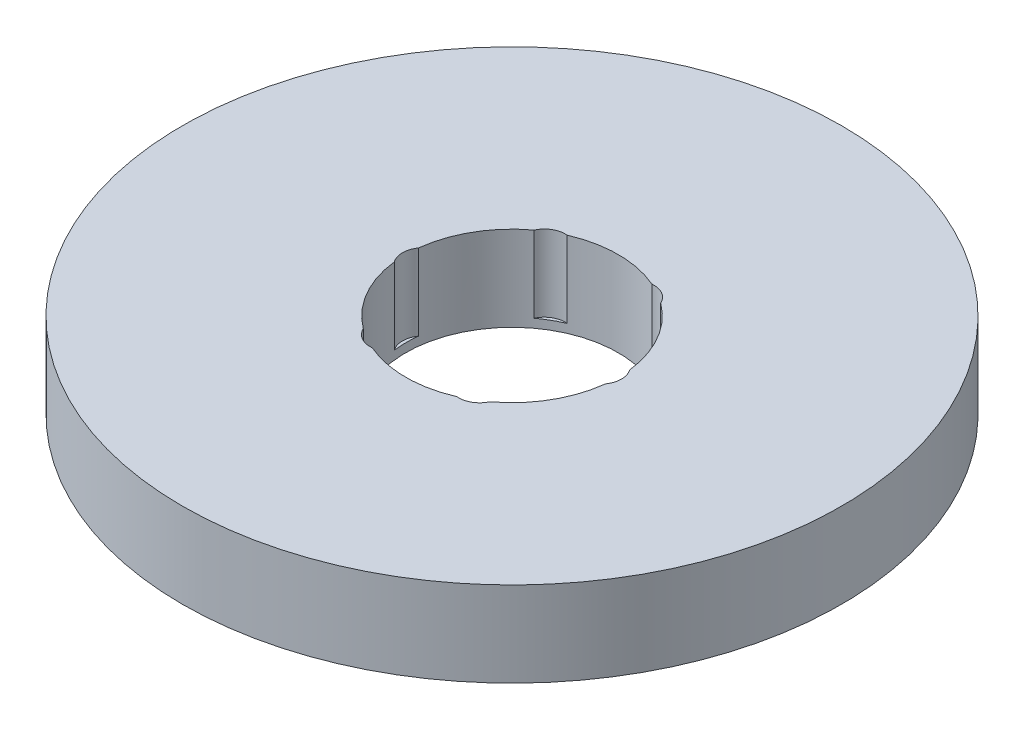
ISO-10303-21;
HEADER;
FILE_DESCRIPTION(('STEP AP214'),'2;1');
FILE_NAME('part.step','',(''),(''),'','','');
FILE_SCHEMA(('AUTOMOTIVE_DESIGN { 1 0 10303 214 1 1 1 1 }'));
ENDSEC;
DATA;
#1=APPLICATION_CONTEXT('core data for automotive mechanical design processes');
#2=APPLICATION_PROTOCOL_DEFINITION('international standard','automotive_design',2000,#1);
#3=PRODUCT_CONTEXT('',#1,'mechanical');
#4=PRODUCT('Part','Part','',(#3));
#5=PRODUCT_RELATED_PRODUCT_CATEGORY('part','',(#4));
#6=PRODUCT_DEFINITION_FORMATION('','',#4);
#7=PRODUCT_DEFINITION_CONTEXT('part definition',#1,'design');
#8=PRODUCT_DEFINITION('design','',#6,#7);
#9=PRODUCT_DEFINITION_SHAPE('','',#8);
#10=(LENGTH_UNIT() NAMED_UNIT(*) SI_UNIT(.MILLI.,.METRE.));
#11=(NAMED_UNIT(*) PLANE_ANGLE_UNIT() SI_UNIT($,.RADIAN.));
#12=(NAMED_UNIT(*) SI_UNIT($,.STERADIAN.) SOLID_ANGLE_UNIT());
#13=UNCERTAINTY_MEASURE_WITH_UNIT(LENGTH_MEASURE(1.E-05),#10,'distance_accuracy_value','');
#14=(GEOMETRIC_REPRESENTATION_CONTEXT(3) GLOBAL_UNCERTAINTY_ASSIGNED_CONTEXT((#13)) GLOBAL_UNIT_ASSIGNED_CONTEXT((#10,
#11,#12)) REPRESENTATION_CONTEXT('',''));
#15=CARTESIAN_POINT('',(0.,0.,0.));
#16=DIRECTION('',(0.,0.,1.));
#17=DIRECTION('',(1.,0.,0.));
#18=AXIS2_PLACEMENT_3D('',#15,#16,#17);
#19=CARTESIAN_POINT('',(0.,20.,0.));
#20=DIRECTION('',(0.,-1.,0.));
#21=DIRECTION('',(0.,0.,-1.));
#22=AXIS2_PLACEMENT_3D('',#19,#20,#21);
#23=CYLINDRICAL_SURFACE('',#22,77.5);
#24=CARTESIAN_POINT('',(0.,20.,0.));
#25=DIRECTION('',(0.,1.,0.));
#26=DIRECTION('',(0.,0.,1.));
#27=AXIS2_PLACEMENT_3D('',#24,#25,#26);
#28=CIRCLE('',#27,77.5);
#29=CARTESIAN_POINT('',(0.,20.,77.5));
#30=VERTEX_POINT('',#29);
#31=EDGE_CURVE('E162',#30,#30,#28,.T.);
#32=ORIENTED_EDGE('',*,*,#31,.F.);
#33=EDGE_LOOP('',(#32));
#34=FACE_BOUND('',#33,.T.);
#35=CARTESIAN_POINT('',(0.,0.,0.));
#36=DIRECTION('',(0.,1.,0.));
#37=DIRECTION('',(0.,0.,1.));
#38=AXIS2_PLACEMENT_3D('',#35,#36,#37);
#39=CIRCLE('',#38,77.5);
#40=CARTESIAN_POINT('',(0.,0.,77.5));
#41=VERTEX_POINT('',#40);
#42=EDGE_CURVE('E157',#41,#41,#39,.T.);
#43=ORIENTED_EDGE('',*,*,#42,.T.);
#44=EDGE_LOOP('',(#43));
#45=FACE_BOUND('',#44,.T.);
#46=ADVANCED_FACE('F39',(#34,#45),#23,.T.);
#47=CARTESIAN_POINT('',(0.,20.,0.));
#48=DIRECTION('',(0.,1.,0.));
#49=DIRECTION('',(0.,0.,1.));
#50=AXIS2_PLACEMENT_3D('',#47,#48,#49);
#51=PLANE('',#50);
#52=CARTESIAN_POINT('',(-10.4162021498453,20.,-18.0413913454397));
#53=DIRECTION('',(0.,1.,0.));
#54=DIRECTION('',(-0.866025403784433,0.,0.50000000000001));
#55=AXIS2_PLACEMENT_3D('',#52,#53,#54);
#56=CIRCLE('',#55,4.91372021426966);
#57=CARTESIAN_POINT('',(-9.95319509724716,20.,-22.9332489489853));
#58=VERTEX_POINT('',#57);
#59=CARTESIAN_POINT('',(-14.8841786325109,20.,-20.0863442775311));
#60=VERTEX_POINT('',#59);
#61=EDGE_CURVE('E218',#58,#60,#56,.T.);
#62=ORIENTED_EDGE('',*,*,#61,.F.);
#63=CARTESIAN_POINT('',(0.,20.,0.));
#64=DIRECTION('',(0.,1.,0.));
#65=DIRECTION('',(0.,0.,1.));
#66=AXIS2_PLACEMENT_3D('',#63,#64,#65);
#67=CIRCLE('',#66,25.);
#68=CARTESIAN_POINT('',(9.95319509724667,20.,-22.9332489489855));
#69=VERTEX_POINT('',#68);
#70=EDGE_CURVE('E169',#69,#58,#67,.T.);
#71=ORIENTED_EDGE('',*,*,#70,.F.);
#72=CARTESIAN_POINT('',(10.4162021498449,20.,-18.0413913454399));
#73=DIRECTION('',(0.,1.,0.));
#74=DIRECTION('',(-0.866025403784443,0.,-0.499999999999992));
#75=AXIS2_PLACEMENT_3D('',#72,#73,#74);
#76=CIRCLE('',#75,4.91372021426966);
#77=CARTESIAN_POINT('',(14.8841786325105,20.,-20.0863442775314));
#78=VERTEX_POINT('',#77);
#79=EDGE_CURVE('E285',#78,#69,#76,.T.);
#80=ORIENTED_EDGE('',*,*,#79,.F.);
#81=CARTESIAN_POINT('',(24.8373737297576,20.,-2.84690467145417));
#82=VERTEX_POINT('',#81);
#83=EDGE_CURVE('E174',#82,#78,#67,.T.);
#84=ORIENTED_EDGE('',*,*,#83,.F.);
#85=CARTESIAN_POINT('',(20.8324042996902,20.,0.));
#86=DIRECTION('',(0.,1.,0.));
#87=DIRECTION('',(0.,0.,-1.));
#88=AXIS2_PLACEMENT_3D('',#85,#86,#87);
#89=CIRCLE('',#88,4.91372021426966);
#90=CARTESIAN_POINT('',(24.8373737297576,20.,2.84690467145417));
#91=VERTEX_POINT('',#90);
#92=EDGE_CURVE('E280',#91,#82,#89,.T.);
#93=ORIENTED_EDGE('',*,*,#92,.F.);
#94=CARTESIAN_POINT('',(14.8841786325108,20.,20.0863442775312));
#95=VERTEX_POINT('',#94);
#96=EDGE_CURVE('E164',#95,#91,#67,.T.);
#97=ORIENTED_EDGE('',*,*,#96,.F.);
#98=CARTESIAN_POINT('',(10.4162021498452,20.,18.0413913454398));
#99=DIRECTION('',(0.,1.,0.));
#100=DIRECTION('',(0.866025403784436,0.,-0.500000000000004));
#101=AXIS2_PLACEMENT_3D('',#98,#99,#100);
#102=CIRCLE('',#101,4.91372021426966);
#103=CARTESIAN_POINT('',(9.95319509724699,20.,22.9332489489854));
#104=VERTEX_POINT('',#103);
#105=EDGE_CURVE('E269',#104,#95,#102,.T.);
#106=ORIENTED_EDGE('',*,*,#105,.F.);
#107=CARTESIAN_POINT('',(-9.95319509724684,20.,22.9332489489854));
#108=VERTEX_POINT('',#107);
#109=EDGE_CURVE('E149',#108,#104,#67,.T.);
#110=ORIENTED_EDGE('',*,*,#109,.F.);
#111=CARTESIAN_POINT('',(-10.416202149845,20.,18.0413913454399));
#112=DIRECTION('',(0.,1.,0.));
#113=DIRECTION('',(0.86602540378444,0.,0.499999999999998));
#114=AXIS2_PLACEMENT_3D('',#111,#112,#113);
#115=CIRCLE('',#114,4.91372021426966);
#116=CARTESIAN_POINT('',(-14.8841786325107,20.,20.0863442775313));
#117=VERTEX_POINT('',#116);
#118=EDGE_CURVE('E128',#117,#108,#115,.T.);
#119=ORIENTED_EDGE('',*,*,#118,.F.);
#120=CARTESIAN_POINT('',(-24.8373737297576,20.,2.84690467145417));
#121=VERTEX_POINT('',#120);
#122=EDGE_CURVE('E148',#121,#117,#67,.T.);
#123=ORIENTED_EDGE('',*,*,#122,.F.);
#124=CARTESIAN_POINT('',(-20.8324042996902,20.,0.));
#125=DIRECTION('',(0.,1.,0.));
#126=DIRECTION('',(0.,0.,1.));
#127=AXIS2_PLACEMENT_3D('',#124,#125,#126);
#128=CIRCLE('',#127,4.91372021426966);
#129=CARTESIAN_POINT('',(-24.8373737297576,20.,-2.84690467145417));
#130=VERTEX_POINT('',#129);
#131=EDGE_CURVE('E179',#130,#121,#128,.T.);
#132=ORIENTED_EDGE('',*,*,#131,.F.);
#133=EDGE_CURVE('E161',#60,#130,#67,.T.);
#134=ORIENTED_EDGE('',*,*,#133,.F.);
#135=EDGE_LOOP('',(#62,#71,#80,#84,#93,#97,#106,#110,#119,#123,#132,#134));
#136=FACE_BOUND('',#135,.T.);
#137=ORIENTED_EDGE('',*,*,#31,.T.);
#138=EDGE_LOOP('',(#137));
#139=FACE_BOUND('',#138,.T.);
#140=ADVANCED_FACE('F141',(#136,#139),#51,.T.);
#141=CARTESIAN_POINT('',(0.,0.,0.));
#142=DIRECTION('',(0.,1.,0.));
#143=DIRECTION('',(0.,0.,1.));
#144=AXIS2_PLACEMENT_3D('',#141,#142,#143);
#145=PLANE('',#144);
#146=CARTESIAN_POINT('',(0.,0.,0.));
#147=DIRECTION('',(0.,1.,0.));
#148=DIRECTION('',(0.,0.,1.));
#149=AXIS2_PLACEMENT_3D('',#146,#147,#148);
#150=CIRCLE('',#149,25.);
#151=CARTESIAN_POINT('',(0.,0.,25.));
#152=VERTEX_POINT('',#151);
#153=EDGE_CURVE('E166',#152,#152,#150,.T.);
#154=ORIENTED_EDGE('',*,*,#153,.T.);
#155=EDGE_LOOP('',(#154));
#156=FACE_BOUND('',#155,.T.);
#157=ORIENTED_EDGE('',*,*,#42,.F.);
#158=EDGE_LOOP('',(#157));
#159=FACE_BOUND('',#158,.T.);
#160=ADVANCED_FACE('F234',(#156,#159),#145,.F.);
#161=CARTESIAN_POINT('',(0.,20.,0.));
#162=DIRECTION('',(0.,-1.,0.));
#163=DIRECTION('',(0.,0.,-1.));
#164=AXIS2_PLACEMENT_3D('',#161,#162,#163);
#165=CYLINDRICAL_SURFACE('',#164,25.);
#166=DIRECTION('',(0.,1.,0.));
#167=VECTOR('',#166,1.);
#168=CARTESIAN_POINT('',(-9.95319509724715,11.0183075650183,-22.9332489489853));
#169=LINE('',#168,#167);
#170=CARTESIAN_POINT('',(-9.95319509724716,2.03661513003655,-22.9332489489853));
#171=VERTEX_POINT('',#170);
#172=EDGE_CURVE('E11',#171,#58,#169,.T.);
#173=ORIENTED_EDGE('',*,*,#172,.F.);
#174=CARTESIAN_POINT('',(0.,2.03661513003655,0.));
#175=DIRECTION('',(0.,1.,0.));
#176=DIRECTION('',(0.,0.,1.));
#177=AXIS2_PLACEMENT_3D('',#174,#175,#176);
#178=CIRCLE('',#177,25.);
#179=CARTESIAN_POINT('',(-14.8841786325109,2.03661513003655,-20.0863442775311));
#180=VERTEX_POINT('',#179);
#181=EDGE_CURVE('E214',#171,#180,#178,.T.);
#182=ORIENTED_EDGE('',*,*,#181,.T.);
#183=DIRECTION('',(0.,1.,0.));
#184=VECTOR('',#183,1.);
#185=CARTESIAN_POINT('',(-14.8841786325109,11.0183075650183,-20.0863442775311));
#186=LINE('',#185,#184);
#187=EDGE_CURVE('E46',#60,#180,#186,.F.);
#188=ORIENTED_EDGE('',*,*,#187,.F.);
#189=ORIENTED_EDGE('',*,*,#133,.T.);
#190=DIRECTION('',(0.,1.,0.));
#191=VECTOR('',#190,1.);
#192=CARTESIAN_POINT('',(-24.8373737297576,11.0183075650183,-2.84690467145418));
#193=LINE('',#192,#191);
#194=CARTESIAN_POINT('',(-24.8373737297576,2.03661513003655,-2.84690467145417));
#195=VERTEX_POINT('',#194);
#196=EDGE_CURVE('E187',#195,#130,#193,.T.);
#197=ORIENTED_EDGE('',*,*,#196,.F.);
#198=CARTESIAN_POINT('',(0.,2.03661513003655,0.));
#199=DIRECTION('',(0.,1.,0.));
#200=DIRECTION('',(0.,0.,1.));
#201=AXIS2_PLACEMENT_3D('',#198,#199,#200);
#202=CIRCLE('',#201,25.);
#203=CARTESIAN_POINT('',(-24.8373737297576,2.03661513003655,2.84690467145417));
#204=VERTEX_POINT('',#203);
#205=EDGE_CURVE('E184',#195,#204,#202,.T.);
#206=ORIENTED_EDGE('',*,*,#205,.T.);
#207=DIRECTION('',(0.,1.,0.));
#208=VECTOR('',#207,1.);
#209=CARTESIAN_POINT('',(-24.8373737297576,11.0183075650183,2.84690467145418));
#210=LINE('',#209,#208);
#211=EDGE_CURVE('E158',#121,#204,#210,.F.);
#212=ORIENTED_EDGE('',*,*,#211,.F.);
#213=ORIENTED_EDGE('',*,*,#122,.T.);
#214=DIRECTION('',(0.,1.,0.));
#215=VECTOR('',#214,1.);
#216=CARTESIAN_POINT('',(-14.8841786325107,11.0183075650183,20.0863442775313));
#217=LINE('',#216,#215);
#218=CARTESIAN_POINT('',(-14.8841786325107,2.03661513003655,20.0863442775313));
#219=VERTEX_POINT('',#218);
#220=EDGE_CURVE('E127',#219,#117,#217,.T.);
#221=ORIENTED_EDGE('',*,*,#220,.F.);
#222=CARTESIAN_POINT('',(0.,2.03661513003655,0.));
#223=DIRECTION('',(0.,1.,0.));
#224=DIRECTION('',(0.,0.,1.));
#225=AXIS2_PLACEMENT_3D('',#222,#223,#224);
#226=CIRCLE('',#225,25.);
#227=CARTESIAN_POINT('',(-9.95319509724684,2.03661513003655,22.9332489489854));
#228=VERTEX_POINT('',#227);
#229=EDGE_CURVE('E189',#219,#228,#226,.T.);
#230=ORIENTED_EDGE('',*,*,#229,.T.);
#231=DIRECTION('',(0.,1.,0.));
#232=VECTOR('',#231,1.);
#233=CARTESIAN_POINT('',(-9.95319509724683,11.0183075650183,22.9332489489854));
#234=LINE('',#233,#232);
#235=EDGE_CURVE('E140',#108,#228,#234,.F.);
#236=ORIENTED_EDGE('',*,*,#235,.F.);
#237=ORIENTED_EDGE('',*,*,#109,.T.);
#238=DIRECTION('',(0.,1.,0.));
#239=VECTOR('',#238,1.);
#240=CARTESIAN_POINT('',(9.95319509724699,11.0183075650183,22.9332489489854));
#241=LINE('',#240,#239);
#242=CARTESIAN_POINT('',(9.95319509724699,2.03661513003655,22.9332489489854));
#243=VERTEX_POINT('',#242);
#244=EDGE_CURVE('E196',#243,#104,#241,.T.);
#245=ORIENTED_EDGE('',*,*,#244,.F.);
#246=CARTESIAN_POINT('',(0.,2.03661513003655,0.));
#247=DIRECTION('',(0.,1.,0.));
#248=DIRECTION('',(0.,0.,1.));
#249=AXIS2_PLACEMENT_3D('',#246,#247,#248);
#250=CIRCLE('',#249,25.);
#251=CARTESIAN_POINT('',(14.8841786325108,2.03661513003655,20.0863442775312));
#252=VERTEX_POINT('',#251);
#253=EDGE_CURVE('E136',#243,#252,#250,.T.);
#254=ORIENTED_EDGE('',*,*,#253,.T.);
#255=DIRECTION('',(0.,1.,0.));
#256=VECTOR('',#255,1.);
#257=CARTESIAN_POINT('',(14.8841786325108,11.0183075650183,20.0863442775312));
#258=LINE('',#257,#256);
#259=EDGE_CURVE('E194',#95,#252,#258,.F.);
#260=ORIENTED_EDGE('',*,*,#259,.F.);
#261=ORIENTED_EDGE('',*,*,#96,.T.);
#262=DIRECTION('',(0.,1.,0.));
#263=VECTOR('',#262,1.);
#264=CARTESIAN_POINT('',(24.8373737297576,11.0183075650183,2.84690467145418));
#265=LINE('',#264,#263);
#266=CARTESIAN_POINT('',(24.8373737297576,2.03661513003655,2.84690467145417));
#267=VERTEX_POINT('',#266);
#268=EDGE_CURVE('E206',#267,#91,#265,.T.);
#269=ORIENTED_EDGE('',*,*,#268,.F.);
#270=CARTESIAN_POINT('',(0.,2.03661513003655,0.));
#271=DIRECTION('',(0.,1.,0.));
#272=DIRECTION('',(0.,0.,1.));
#273=AXIS2_PLACEMENT_3D('',#270,#271,#272);
#274=CIRCLE('',#273,25.);
#275=CARTESIAN_POINT('',(24.8373737297576,2.03661513003655,-2.84690467145417));
#276=VERTEX_POINT('',#275);
#277=EDGE_CURVE('E199',#267,#276,#274,.T.);
#278=ORIENTED_EDGE('',*,*,#277,.T.);
#279=DIRECTION('',(0.,1.,0.));
#280=VECTOR('',#279,1.);
#281=CARTESIAN_POINT('',(24.8373737297576,11.0183075650183,-2.84690467145418));
#282=LINE('',#281,#280);
#283=EDGE_CURVE('E201',#82,#276,#282,.F.);
#284=ORIENTED_EDGE('',*,*,#283,.F.);
#285=ORIENTED_EDGE('',*,*,#83,.T.);
#286=DIRECTION('',(0.,1.,0.));
#287=VECTOR('',#286,1.);
#288=CARTESIAN_POINT('',(14.8841786325105,11.0183075650183,-20.0863442775314));
#289=LINE('',#288,#287);
#290=CARTESIAN_POINT('',(14.8841786325105,2.03661513003655,-20.0863442775314));
#291=VERTEX_POINT('',#290);
#292=EDGE_CURVE('E213',#291,#78,#289,.T.);
#293=ORIENTED_EDGE('',*,*,#292,.F.);
#294=CARTESIAN_POINT('',(0.,2.03661513003655,0.));
#295=DIRECTION('',(0.,1.,0.));
#296=DIRECTION('',(0.,0.,1.));
#297=AXIS2_PLACEMENT_3D('',#294,#295,#296);
#298=CIRCLE('',#297,25.);
#299=CARTESIAN_POINT('',(9.95319509724667,2.03661513003655,-22.9332489489855));
#300=VERTEX_POINT('',#299);
#301=EDGE_CURVE('E208',#291,#300,#298,.T.);
#302=ORIENTED_EDGE('',*,*,#301,.T.);
#303=DIRECTION('',(0.,1.,0.));
#304=VECTOR('',#303,1.);
#305=CARTESIAN_POINT('',(9.95319509724667,11.0183075650183,-22.9332489489855));
#306=LINE('',#305,#304);
#307=EDGE_CURVE('E211',#69,#300,#306,.F.);
#308=ORIENTED_EDGE('',*,*,#307,.F.);
#309=ORIENTED_EDGE('',*,*,#70,.T.);
#310=EDGE_LOOP('',(#173,#182,#188,#189,#197,#206,#212,#213,#221,#230,#236,#237,#245,#254,#260,
#261,#269,#278,#284,#285,#293,#302,#308,#309));
#311=FACE_BOUND('',#310,.T.);
#312=ORIENTED_EDGE('',*,*,#153,.F.);
#313=EDGE_LOOP('',(#312));
#314=FACE_BOUND('',#313,.T.);
#315=ADVANCED_FACE('F152',(#311,#314),#165,.F.);
#316=CARTESIAN_POINT('',(-20.8324042996902,2.03661513003655,0.));
#317=DIRECTION('',(0.,1.,0.));
#318=DIRECTION('',(0.,0.,1.));
#319=AXIS2_PLACEMENT_3D('',#316,#317,#318);
#320=CYLINDRICAL_SURFACE('',#319,4.91372021426966);
#321=ORIENTED_EDGE('',*,*,#196,.T.);
#322=ORIENTED_EDGE('',*,*,#131,.T.);
#323=ORIENTED_EDGE('',*,*,#211,.T.);
#324=CARTESIAN_POINT('',(-20.8324042996902,2.03661513003655,0.));
#325=DIRECTION('',(0.,1.,0.));
#326=DIRECTION('',(0.,0.,1.));
#327=AXIS2_PLACEMENT_3D('',#324,#325,#326);
#328=CIRCLE('',#327,4.91372021426966);
#329=EDGE_CURVE('E180',#195,#204,#328,.T.);
#330=ORIENTED_EDGE('',*,*,#329,.F.);
#331=EDGE_LOOP('',(#321,#322,#323,#330));
#332=FACE_BOUND('',#331,.T.);
#333=ADVANCED_FACE('F244',(#332),#320,.F.);
#334=CARTESIAN_POINT('',(-20.8324042996902,2.03661513003655,0.));
#335=DIRECTION('',(0.,1.,0.));
#336=DIRECTION('',(0.,0.,1.));
#337=AXIS2_PLACEMENT_3D('',#334,#335,#336);
#338=PLANE('',#337);
#339=ORIENTED_EDGE('',*,*,#329,.T.);
#340=ORIENTED_EDGE('',*,*,#205,.F.);
#341=EDGE_LOOP('',(#339,#340));
#342=FACE_BOUND('',#341,.T.);
#343=ADVANCED_FACE('F248',(#342),#338,.T.);
#344=CARTESIAN_POINT('',(-10.416202149845,2.03661513003655,18.0413913454399));
#345=DIRECTION('',(0.,1.,0.));
#346=DIRECTION('',(0.,0.,1.));
#347=AXIS2_PLACEMENT_3D('',#344,#345,#346);
#348=CYLINDRICAL_SURFACE('',#347,4.91372021426966);
#349=ORIENTED_EDGE('',*,*,#220,.T.);
#350=ORIENTED_EDGE('',*,*,#118,.T.);
#351=ORIENTED_EDGE('',*,*,#235,.T.);
#352=CARTESIAN_POINT('',(-10.416202149845,2.03661513003655,18.0413913454399));
#353=DIRECTION('',(0.,1.,0.));
#354=DIRECTION('',(0.86602540378444,0.,0.499999999999998));
#355=AXIS2_PLACEMENT_3D('',#352,#353,#354);
#356=CIRCLE('',#355,4.91372021426966);
#357=EDGE_CURVE('E135',#219,#228,#356,.T.);
#358=ORIENTED_EDGE('',*,*,#357,.F.);
#359=EDGE_LOOP('',(#349,#350,#351,#358));
#360=FACE_BOUND('',#359,.T.);
#361=ADVANCED_FACE('F126',(#360),#348,.F.);
#362=CARTESIAN_POINT('',(-10.416202149845,2.03661513003655,18.0413913454399));
#363=DIRECTION('',(0.,1.,0.));
#364=DIRECTION('',(0.86602540378444,0.,0.499999999999998));
#365=AXIS2_PLACEMENT_3D('',#362,#363,#364);
#366=PLANE('',#365);
#367=ORIENTED_EDGE('',*,*,#357,.T.);
#368=ORIENTED_EDGE('',*,*,#229,.F.);
#369=EDGE_LOOP('',(#367,#368));
#370=FACE_BOUND('',#369,.T.);
#371=ADVANCED_FACE('F258',(#370),#366,.T.);
#372=CARTESIAN_POINT('',(10.4162021498452,2.03661513003655,18.0413913454398));
#373=DIRECTION('',(0.,1.,0.));
#374=DIRECTION('',(0.,0.,1.));
#375=AXIS2_PLACEMENT_3D('',#372,#373,#374);
#376=CYLINDRICAL_SURFACE('',#375,4.91372021426966);
#377=ORIENTED_EDGE('',*,*,#244,.T.);
#378=ORIENTED_EDGE('',*,*,#105,.T.);
#379=ORIENTED_EDGE('',*,*,#259,.T.);
#380=CARTESIAN_POINT('',(10.4162021498452,2.03661513003655,18.0413913454398));
#381=DIRECTION('',(0.,1.,0.));
#382=DIRECTION('',(0.866025403784436,0.,-0.500000000000004));
#383=AXIS2_PLACEMENT_3D('',#380,#381,#382);
#384=CIRCLE('',#383,4.91372021426966);
#385=EDGE_CURVE('E147',#243,#252,#384,.T.);
#386=ORIENTED_EDGE('',*,*,#385,.F.);
#387=EDGE_LOOP('',(#377,#378,#379,#386));
#388=FACE_BOUND('',#387,.T.);
#389=ADVANCED_FACE('F256',(#388),#376,.F.);
#390=CARTESIAN_POINT('',(10.4162021498452,2.03661513003655,18.0413913454398));
#391=DIRECTION('',(0.,1.,0.));
#392=DIRECTION('',(0.866025403784436,0.,-0.500000000000004));
#393=AXIS2_PLACEMENT_3D('',#390,#391,#392);
#394=PLANE('',#393);
#395=ORIENTED_EDGE('',*,*,#385,.T.);
#396=ORIENTED_EDGE('',*,*,#253,.F.);
#397=EDGE_LOOP('',(#395,#396));
#398=FACE_BOUND('',#397,.T.);
#399=ADVANCED_FACE('F263',(#398),#394,.T.);
#400=CARTESIAN_POINT('',(20.8324042996902,2.03661513003655,0.));
#401=DIRECTION('',(0.,1.,0.));
#402=DIRECTION('',(0.,0.,1.));
#403=AXIS2_PLACEMENT_3D('',#400,#401,#402);
#404=CYLINDRICAL_SURFACE('',#403,4.91372021426966);
#405=ORIENTED_EDGE('',*,*,#268,.T.);
#406=ORIENTED_EDGE('',*,*,#92,.T.);
#407=ORIENTED_EDGE('',*,*,#283,.T.);
#408=CARTESIAN_POINT('',(20.8324042996902,2.03661513003655,0.));
#409=DIRECTION('',(0.,1.,0.));
#410=DIRECTION('',(0.,0.,-1.));
#411=AXIS2_PLACEMENT_3D('',#408,#409,#410);
#412=CIRCLE('',#411,4.91372021426966);
#413=EDGE_CURVE('E273',#267,#276,#412,.T.);
#414=ORIENTED_EDGE('',*,*,#413,.F.);
#415=EDGE_LOOP('',(#405,#406,#407,#414));
#416=FACE_BOUND('',#415,.T.);
#417=ADVANCED_FACE('F297',(#416),#404,.F.);
#418=CARTESIAN_POINT('',(20.8324042996902,2.03661513003655,0.));
#419=DIRECTION('',(0.,1.,0.));
#420=DIRECTION('',(0.,0.,-1.));
#421=AXIS2_PLACEMENT_3D('',#418,#419,#420);
#422=PLANE('',#421);
#423=ORIENTED_EDGE('',*,*,#413,.T.);
#424=ORIENTED_EDGE('',*,*,#277,.F.);
#425=EDGE_LOOP('',(#423,#424));
#426=FACE_BOUND('',#425,.T.);
#427=ADVANCED_FACE('F299',(#426),#422,.T.);
#428=CARTESIAN_POINT('',(10.4162021498449,2.03661513003655,-18.0413913454399));
#429=DIRECTION('',(0.,1.,0.));
#430=DIRECTION('',(0.,0.,1.));
#431=AXIS2_PLACEMENT_3D('',#428,#429,#430);
#432=CYLINDRICAL_SURFACE('',#431,4.91372021426966);
#433=ORIENTED_EDGE('',*,*,#292,.T.);
#434=ORIENTED_EDGE('',*,*,#79,.T.);
#435=ORIENTED_EDGE('',*,*,#307,.T.);
#436=CARTESIAN_POINT('',(10.4162021498449,2.03661513003655,-18.0413913454399));
#437=DIRECTION('',(0.,1.,0.));
#438=DIRECTION('',(-0.866025403784443,0.,-0.499999999999992));
#439=AXIS2_PLACEMENT_3D('',#436,#437,#438);
#440=CIRCLE('',#439,4.91372021426966);
#441=EDGE_CURVE('E56',#291,#300,#440,.T.);
#442=ORIENTED_EDGE('',*,*,#441,.F.);
#443=EDGE_LOOP('',(#433,#434,#435,#442));
#444=FACE_BOUND('',#443,.T.);
#445=ADVANCED_FACE('F292',(#444),#432,.F.);
#446=CARTESIAN_POINT('',(10.4162021498449,2.03661513003655,-18.0413913454399));
#447=DIRECTION('',(0.,1.,0.));
#448=DIRECTION('',(-0.866025403784443,0.,-0.499999999999992));
#449=AXIS2_PLACEMENT_3D('',#446,#447,#448);
#450=PLANE('',#449);
#451=ORIENTED_EDGE('',*,*,#441,.T.);
#452=ORIENTED_EDGE('',*,*,#301,.F.);
#453=EDGE_LOOP('',(#451,#452));
#454=FACE_BOUND('',#453,.T.);
#455=ADVANCED_FACE('F226',(#454),#450,.T.);
#456=CARTESIAN_POINT('',(-10.4162021498453,2.03661513003655,-18.0413913454397));
#457=DIRECTION('',(0.,1.,0.));
#458=DIRECTION('',(0.,0.,1.));
#459=AXIS2_PLACEMENT_3D('',#456,#457,#458);
#460=CYLINDRICAL_SURFACE('',#459,4.91372021426966);
#461=ORIENTED_EDGE('',*,*,#172,.T.);
#462=ORIENTED_EDGE('',*,*,#61,.T.);
#463=ORIENTED_EDGE('',*,*,#187,.T.);
#464=CARTESIAN_POINT('',(-10.4162021498453,2.03661513003655,-18.0413913454397));
#465=DIRECTION('',(0.,1.,0.));
#466=DIRECTION('',(-0.866025403784433,0.,0.50000000000001));
#467=AXIS2_PLACEMENT_3D('',#464,#465,#466);
#468=CIRCLE('',#467,4.91372021426966);
#469=EDGE_CURVE('E55',#171,#180,#468,.T.);
#470=ORIENTED_EDGE('',*,*,#469,.F.);
#471=EDGE_LOOP('',(#461,#462,#463,#470));
#472=FACE_BOUND('',#471,.T.);
#473=ADVANCED_FACE('F217',(#472),#460,.F.);
#474=CARTESIAN_POINT('',(-10.4162021498453,2.03661513003655,-18.0413913454397));
#475=DIRECTION('',(0.,1.,0.));
#476=DIRECTION('',(-0.866025403784433,0.,0.50000000000001));
#477=AXIS2_PLACEMENT_3D('',#474,#475,#476);
#478=PLANE('',#477);
#479=ORIENTED_EDGE('',*,*,#469,.T.);
#480=ORIENTED_EDGE('',*,*,#181,.F.);
#481=EDGE_LOOP('',(#479,#480));
#482=FACE_BOUND('',#481,.T.);
#483=ADVANCED_FACE('F219',(#482),#478,.T.);
#484=CLOSED_SHELL('',(#46,#140,#160,#315,#333,#343,#361,#371,#389,#399,#417,#427,#445,#455,#473,#483));
#485=MANIFOLD_SOLID_BREP('B2',#484);
#486=ADVANCED_BREP_SHAPE_REPRESENTATION('',(#18,#485),#14);
#487=SHAPE_DEFINITION_REPRESENTATION(#9,#486);
ENDSEC;
END-ISO-10303-21;
